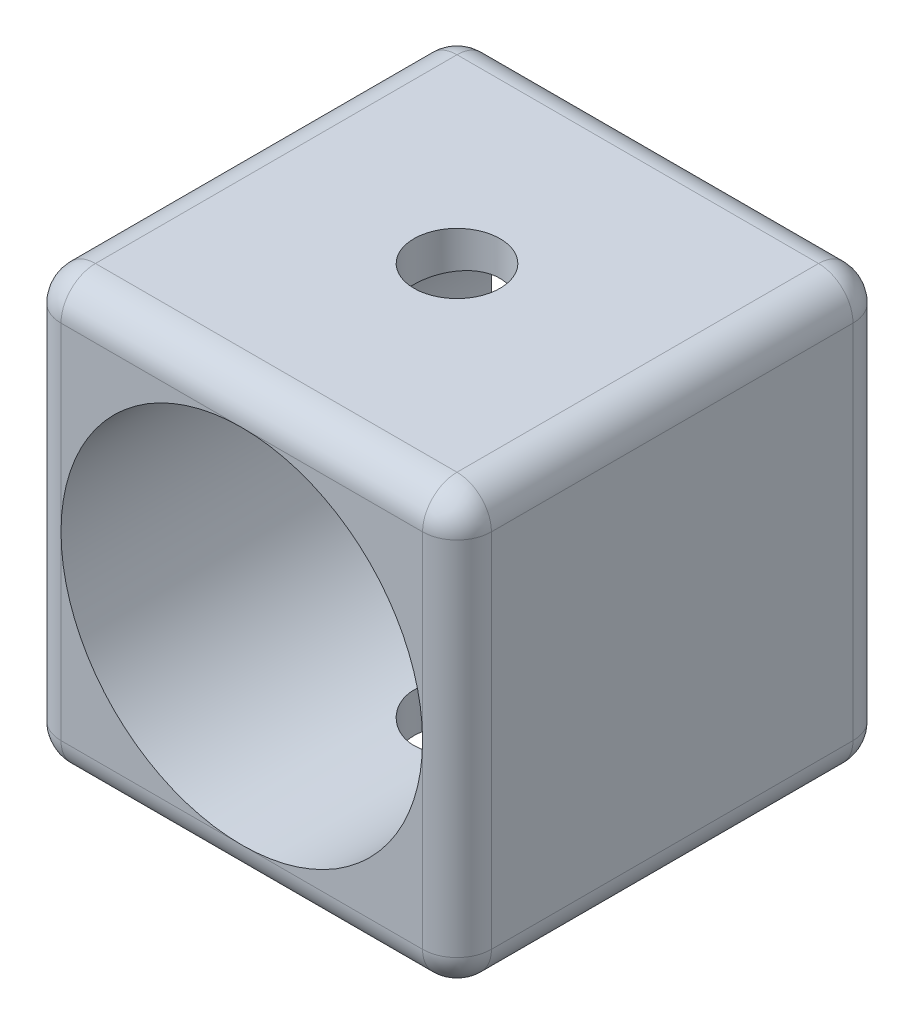
ISO-10303-21;
HEADER;
FILE_DESCRIPTION(('STEP AP214'),'2;1');
FILE_NAME('part.step','',(''),(''),'','','');
FILE_SCHEMA(('AUTOMOTIVE_DESIGN { 1 0 10303 214 1 1 1 1 }'));
ENDSEC;
DATA;
#1=APPLICATION_CONTEXT('core data for automotive mechanical design processes');
#2=APPLICATION_PROTOCOL_DEFINITION('international standard','automotive_design',2000,#1);
#3=PRODUCT_CONTEXT('',#1,'mechanical');
#4=PRODUCT('Part','Part','',(#3));
#5=PRODUCT_RELATED_PRODUCT_CATEGORY('part','',(#4));
#6=PRODUCT_DEFINITION_FORMATION('','',#4);
#7=PRODUCT_DEFINITION_CONTEXT('part definition',#1,'design');
#8=PRODUCT_DEFINITION('design','',#6,#7);
#9=PRODUCT_DEFINITION_SHAPE('','',#8);
#10=(LENGTH_UNIT() NAMED_UNIT(*) SI_UNIT(.MILLI.,.METRE.));
#11=(NAMED_UNIT(*) PLANE_ANGLE_UNIT() SI_UNIT($,.RADIAN.));
#12=(NAMED_UNIT(*) SI_UNIT($,.STERADIAN.) SOLID_ANGLE_UNIT());
#13=UNCERTAINTY_MEASURE_WITH_UNIT(LENGTH_MEASURE(1.E-05),#10,'distance_accuracy_value','');
#14=(GEOMETRIC_REPRESENTATION_CONTEXT(3) GLOBAL_UNCERTAINTY_ASSIGNED_CONTEXT((#13)) GLOBAL_UNIT_ASSIGNED_CONTEXT((#10,
#11,#12)) REPRESENTATION_CONTEXT('',''));
#15=CARTESIAN_POINT('',(0.,0.,0.));
#16=DIRECTION('',(0.,0.,1.));
#17=DIRECTION('',(1.,0.,0.));
#18=AXIS2_PLACEMENT_3D('',#15,#16,#17);
#19=CARTESIAN_POINT('',(12.5,25.,12.5));
#20=DIRECTION('',(0.,0.,-1.));
#21=DIRECTION('',(-1.,0.,0.));
#22=AXIS2_PLACEMENT_3D('',#19,#20,#21);
#23=PLANE('',#22);
#24=CARTESIAN_POINT('',(0.,12.5,12.5));
#25=DIRECTION('',(0.,0.,1.));
#26=DIRECTION('',(1.,0.,0.));
#27=AXIS2_PLACEMENT_3D('',#24,#25,#26);
#28=CIRCLE('',#27,10.5);
#29=CARTESIAN_POINT('',(0.,23.,12.5));
#30=VERTEX_POINT('',#29);
#31=CARTESIAN_POINT('',(-10.5,12.5,12.5));
#32=VERTEX_POINT('',#31);
#33=EDGE_CURVE('E391',#30,#32,#28,.T.);
#34=ORIENTED_EDGE('',*,*,#33,.F.);
#35=DIRECTION('',(1.,0.,0.));
#36=VECTOR('',#35,1.);
#37=CARTESIAN_POINT('',(-12.5,23.,12.5));
#38=LINE('',#37,#36);
#39=CARTESIAN_POINT('',(-10.5,23.,12.5));
#40=VERTEX_POINT('',#39);
#41=EDGE_CURVE('E285',#30,#40,#38,.F.);
#42=ORIENTED_EDGE('',*,*,#41,.T.);
#43=DIRECTION('',(0.,-1.,0.));
#44=VECTOR('',#43,1.);
#45=CARTESIAN_POINT('',(-10.5,25.,12.5));
#46=LINE('',#45,#44);
#47=EDGE_CURVE('E281',#40,#32,#46,.T.);
#48=ORIENTED_EDGE('',*,*,#47,.T.);
#49=EDGE_LOOP('',(#34,#42,#48));
#50=FACE_BOUND('',#49,.T.);
#51=ADVANCED_FACE('F38',(#50),#23,.F.);
#52=CARTESIAN_POINT('',(0.,2.,12.5));
#53=VERTEX_POINT('',#52);
#54=EDGE_CURVE('E493',#32,#53,#28,.T.);
#55=ORIENTED_EDGE('',*,*,#54,.F.);
#56=DIRECTION('',(0.,-1.,0.));
#57=VECTOR('',#56,1.);
#58=CARTESIAN_POINT('',(-10.5,25.,12.5));
#59=LINE('',#58,#57);
#60=CARTESIAN_POINT('',(-10.5,2.,12.5));
#61=VERTEX_POINT('',#60);
#62=EDGE_CURVE('E278',#32,#61,#59,.T.);
#63=ORIENTED_EDGE('',*,*,#62,.T.);
#64=DIRECTION('',(1.,0.,0.));
#65=VECTOR('',#64,1.);
#66=CARTESIAN_POINT('',(12.5,2.,12.5));
#67=LINE('',#66,#65);
#68=EDGE_CURVE('E273',#61,#53,#67,.T.);
#69=ORIENTED_EDGE('',*,*,#68,.T.);
#70=EDGE_LOOP('',(#55,#63,#69));
#71=FACE_BOUND('',#70,.T.);
#72=ADVANCED_FACE('F416',(#71),#23,.F.);
#73=DIRECTION('',(0.,-1.,0.));
#74=VECTOR('',#73,1.);
#75=CARTESIAN_POINT('',(10.5,25.,12.5));
#76=LINE('',#75,#74);
#77=CARTESIAN_POINT('',(10.5,12.5,12.5));
#78=VERTEX_POINT('',#77);
#79=CARTESIAN_POINT('',(10.5,23.,12.5));
#80=VERTEX_POINT('',#79);
#81=EDGE_CURVE('E264',#78,#80,#76,.F.);
#82=ORIENTED_EDGE('',*,*,#81,.T.);
#83=DIRECTION('',(1.,0.,0.));
#84=VECTOR('',#83,1.);
#85=CARTESIAN_POINT('',(-12.5,23.,12.5));
#86=LINE('',#85,#84);
#87=EDGE_CURVE('E171',#80,#30,#86,.F.);
#88=ORIENTED_EDGE('',*,*,#87,.T.);
#89=EDGE_CURVE('E388',#78,#30,#28,.T.);
#90=ORIENTED_EDGE('',*,*,#89,.F.);
#91=EDGE_LOOP('',(#82,#88,#90));
#92=FACE_BOUND('',#91,.T.);
#93=ADVANCED_FACE('F423',(#92),#23,.F.);
#94=CARTESIAN_POINT('',(12.5,25.,-12.5));
#95=DIRECTION('',(0.,0.,1.));
#96=DIRECTION('',(1.,0.,0.));
#97=AXIS2_PLACEMENT_3D('',#94,#95,#96);
#98=PLANE('',#97);
#99=CARTESIAN_POINT('',(0.,12.5,-12.5));
#100=DIRECTION('',(0.,0.,1.));
#101=DIRECTION('',(1.,0.,0.));
#102=AXIS2_PLACEMENT_3D('',#99,#100,#101);
#103=CIRCLE('',#102,10.5);
#104=CARTESIAN_POINT('',(0.,2.,-12.5));
#105=VERTEX_POINT('',#104);
#106=CARTESIAN_POINT('',(-10.5,12.5,-12.5));
#107=VERTEX_POINT('',#106);
#108=EDGE_CURVE('E196',#105,#107,#103,.F.);
#109=ORIENTED_EDGE('',*,*,#108,.F.);
#110=DIRECTION('',(-1.,0.,0.));
#111=VECTOR('',#110,1.);
#112=CARTESIAN_POINT('',(12.5,2.,-12.5));
#113=LINE('',#112,#111);
#114=CARTESIAN_POINT('',(-10.5,2.,-12.5));
#115=VERTEX_POINT('',#114);
#116=EDGE_CURVE('E235',#105,#115,#113,.T.);
#117=ORIENTED_EDGE('',*,*,#116,.T.);
#118=DIRECTION('',(0.,-1.,0.));
#119=VECTOR('',#118,1.);
#120=CARTESIAN_POINT('',(-10.5,25.,-12.5));
#121=LINE('',#120,#119);
#122=EDGE_CURVE('E232',#115,#107,#121,.F.);
#123=ORIENTED_EDGE('',*,*,#122,.T.);
#124=EDGE_LOOP('',(#109,#117,#123));
#125=FACE_BOUND('',#124,.T.);
#126=ADVANCED_FACE('F441',(#125),#98,.F.);
#127=CARTESIAN_POINT('',(0.,23.,-12.5));
#128=VERTEX_POINT('',#127);
#129=EDGE_CURVE('E504',#107,#128,#103,.F.);
#130=ORIENTED_EDGE('',*,*,#129,.F.);
#131=DIRECTION('',(0.,-1.,0.));
#132=VECTOR('',#131,1.);
#133=CARTESIAN_POINT('',(-10.5,25.,-12.5));
#134=LINE('',#133,#132);
#135=CARTESIAN_POINT('',(-10.5,23.,-12.5));
#136=VERTEX_POINT('',#135);
#137=EDGE_CURVE('E229',#107,#136,#134,.F.);
#138=ORIENTED_EDGE('',*,*,#137,.T.);
#139=DIRECTION('',(-1.,0.,0.));
#140=VECTOR('',#139,1.);
#141=CARTESIAN_POINT('',(12.5,23.,-12.5));
#142=LINE('',#141,#140);
#143=EDGE_CURVE('E225',#136,#128,#142,.F.);
#144=ORIENTED_EDGE('',*,*,#143,.T.);
#145=EDGE_LOOP('',(#130,#138,#144));
#146=FACE_BOUND('',#145,.T.);
#147=ADVANCED_FACE('F446',(#146),#98,.F.);
#148=CARTESIAN_POINT('',(10.5,12.5,-12.5));
#149=VERTEX_POINT('',#148);
#150=EDGE_CURVE('E198',#128,#149,#103,.F.);
#151=ORIENTED_EDGE('',*,*,#150,.F.);
#152=DIRECTION('',(-1.,0.,0.));
#153=VECTOR('',#152,1.);
#154=CARTESIAN_POINT('',(12.5,23.,-12.5));
#155=LINE('',#154,#153);
#156=CARTESIAN_POINT('',(10.5,23.,-12.5));
#157=VERTEX_POINT('',#156);
#158=EDGE_CURVE('E222',#128,#157,#155,.F.);
#159=ORIENTED_EDGE('',*,*,#158,.T.);
#160=DIRECTION('',(0.,-1.,0.));
#161=VECTOR('',#160,1.);
#162=CARTESIAN_POINT('',(10.5,25.,-12.5));
#163=LINE('',#162,#161);
#164=EDGE_CURVE('E216',#157,#149,#163,.T.);
#165=ORIENTED_EDGE('',*,*,#164,.T.);
#166=EDGE_LOOP('',(#151,#159,#165));
#167=FACE_BOUND('',#166,.T.);
#168=ADVANCED_FACE('F437',(#167),#98,.F.);
#169=CARTESIAN_POINT('',(-12.5,25.,12.5));
#170=DIRECTION('',(1.,0.,0.));
#171=DIRECTION('',(0.,0.,-1.));
#172=AXIS2_PLACEMENT_3D('',#169,#170,#171);
#173=PLANE('',#172);
#174=DIRECTION('',(0.,0.,1.));
#175=VECTOR('',#174,1.);
#176=CARTESIAN_POINT('',(-12.5,23.,-12.5));
#177=LINE('',#176,#175);
#178=CARTESIAN_POINT('',(-12.5,23.,10.5));
#179=VERTEX_POINT('',#178);
#180=CARTESIAN_POINT('',(-12.5,23.,-10.5));
#181=VERTEX_POINT('',#180);
#182=EDGE_CURVE('E257',#179,#181,#177,.F.);
#183=ORIENTED_EDGE('',*,*,#182,.T.);
#184=DIRECTION('',(0.,-1.,0.));
#185=VECTOR('',#184,1.);
#186=CARTESIAN_POINT('',(-12.5,25.,-10.5));
#187=LINE('',#186,#185);
#188=CARTESIAN_POINT('',(-12.5,2.,-10.5));
#189=VERTEX_POINT('',#188);
#190=EDGE_CURVE('E260',#181,#189,#187,.T.);
#191=ORIENTED_EDGE('',*,*,#190,.T.);
#192=DIRECTION('',(0.,0.,1.));
#193=VECTOR('',#192,1.);
#194=CARTESIAN_POINT('',(-12.5,2.,12.5));
#195=LINE('',#194,#193);
#196=CARTESIAN_POINT('',(-12.5,2.,10.5));
#197=VERTEX_POINT('',#196);
#198=EDGE_CURVE('E254',#189,#197,#195,.T.);
#199=ORIENTED_EDGE('',*,*,#198,.T.);
#200=DIRECTION('',(0.,-1.,0.));
#201=VECTOR('',#200,1.);
#202=CARTESIAN_POINT('',(-12.5,25.,10.5));
#203=LINE('',#202,#201);
#204=EDGE_CURVE('E251',#197,#179,#203,.F.);
#205=ORIENTED_EDGE('',*,*,#204,.T.);
#206=EDGE_LOOP('',(#183,#191,#199,#205));
#207=FACE_BOUND('',#206,.T.);
#208=ADVANCED_FACE('F430',(#207),#173,.F.);
#209=EDGE_CURVE('E392',#53,#78,#28,.T.);
#210=ORIENTED_EDGE('',*,*,#209,.F.);
#211=DIRECTION('',(1.,0.,0.));
#212=VECTOR('',#211,1.);
#213=CARTESIAN_POINT('',(12.5,2.,12.5));
#214=LINE('',#213,#212);
#215=CARTESIAN_POINT('',(10.5,2.,12.5));
#216=VERTEX_POINT('',#215);
#217=EDGE_CURVE('E270',#53,#216,#214,.T.);
#218=ORIENTED_EDGE('',*,*,#217,.T.);
#219=DIRECTION('',(0.,-1.,0.));
#220=VECTOR('',#219,1.);
#221=CARTESIAN_POINT('',(10.5,25.,12.5));
#222=LINE('',#221,#220);
#223=EDGE_CURVE('E267',#216,#78,#222,.F.);
#224=ORIENTED_EDGE('',*,*,#223,.T.);
#225=EDGE_LOOP('',(#210,#218,#224));
#226=FACE_BOUND('',#225,.T.);
#227=ADVANCED_FACE('F419',(#226),#23,.F.);
#228=CARTESIAN_POINT('',(12.5,25.,12.5));
#229=DIRECTION('',(-1.,0.,0.));
#230=DIRECTION('',(0.,0.,1.));
#231=AXIS2_PLACEMENT_3D('',#228,#229,#230);
#232=PLANE('',#231);
#233=DIRECTION('',(0.,0.,-1.));
#234=VECTOR('',#233,1.);
#235=CARTESIAN_POINT('',(12.5,23.,12.5));
#236=LINE('',#235,#234);
#237=CARTESIAN_POINT('',(12.5,23.,-10.5));
#238=VERTEX_POINT('',#237);
#239=CARTESIAN_POINT('',(12.5,23.,10.5));
#240=VERTEX_POINT('',#239);
#241=EDGE_CURVE('E48',#238,#240,#236,.F.);
#242=ORIENTED_EDGE('',*,*,#241,.T.);
#243=DIRECTION('',(0.,-1.,0.));
#244=VECTOR('',#243,1.);
#245=CARTESIAN_POINT('',(12.5,25.,10.5));
#246=LINE('',#245,#244);
#247=CARTESIAN_POINT('',(12.5,2.,10.5));
#248=VERTEX_POINT('',#247);
#249=EDGE_CURVE('E11',#240,#248,#246,.T.);
#250=ORIENTED_EDGE('',*,*,#249,.T.);
#251=DIRECTION('',(0.,0.,-1.));
#252=VECTOR('',#251,1.);
#253=CARTESIAN_POINT('',(12.5,2.,12.5));
#254=LINE('',#253,#252);
#255=CARTESIAN_POINT('',(12.5,2.,-10.5));
#256=VERTEX_POINT('',#255);
#257=EDGE_CURVE('E288',#248,#256,#254,.T.);
#258=ORIENTED_EDGE('',*,*,#257,.T.);
#259=DIRECTION('',(0.,-1.,0.));
#260=VECTOR('',#259,1.);
#261=CARTESIAN_POINT('',(12.5,25.,-10.5));
#262=LINE('',#261,#260);
#263=EDGE_CURVE('E59',#256,#238,#262,.F.);
#264=ORIENTED_EDGE('',*,*,#263,.T.);
#265=EDGE_LOOP('',(#242,#250,#258,#264));
#266=FACE_BOUND('',#265,.T.);
#267=ADVANCED_FACE('F429',(#266),#232,.F.);
#268=DIRECTION('',(0.,-1.,0.));
#269=VECTOR('',#268,1.);
#270=CARTESIAN_POINT('',(10.5,25.,-12.5));
#271=LINE('',#270,#269);
#272=CARTESIAN_POINT('',(10.5,2.,-12.5));
#273=VERTEX_POINT('',#272);
#274=EDGE_CURVE('E213',#149,#273,#271,.T.);
#275=ORIENTED_EDGE('',*,*,#274,.T.);
#276=DIRECTION('',(-1.,0.,0.));
#277=VECTOR('',#276,1.);
#278=CARTESIAN_POINT('',(12.5,2.,-12.5));
#279=LINE('',#278,#277);
#280=EDGE_CURVE('E219',#273,#105,#279,.T.);
#281=ORIENTED_EDGE('',*,*,#280,.T.);
#282=EDGE_CURVE('E192',#149,#105,#103,.F.);
#283=ORIENTED_EDGE('',*,*,#282,.F.);
#284=EDGE_LOOP('',(#275,#281,#283));
#285=FACE_BOUND('',#284,.T.);
#286=ADVANCED_FACE('F436',(#285),#98,.F.);
#287=CARTESIAN_POINT('',(0.,25.,0.));
#288=DIRECTION('',(0.,1.,0.));
#289=DIRECTION('',(0.,0.,1.));
#290=AXIS2_PLACEMENT_3D('',#287,#288,#289);
#291=PLANE('',#290);
#292=DIRECTION('',(0.,0.,-1.));
#293=VECTOR('',#292,1.);
#294=CARTESIAN_POINT('',(10.5,25.,-12.5));
#295=LINE('',#294,#293);
#296=CARTESIAN_POINT('',(10.5,25.,10.5));
#297=VERTEX_POINT('',#296);
#298=CARTESIAN_POINT('',(10.5,25.,-10.5));
#299=VERTEX_POINT('',#298);
#300=EDGE_CURVE('E156',#297,#299,#295,.T.);
#301=ORIENTED_EDGE('',*,*,#300,.T.);
#302=DIRECTION('',(-1.,0.,0.));
#303=VECTOR('',#302,1.);
#304=CARTESIAN_POINT('',(-12.5,25.,-10.5));
#305=LINE('',#304,#303);
#306=CARTESIAN_POINT('',(-10.5,25.,-10.5));
#307=VERTEX_POINT('',#306);
#308=EDGE_CURVE('E210',#299,#307,#305,.T.);
#309=ORIENTED_EDGE('',*,*,#308,.T.);
#310=DIRECTION('',(0.,0.,1.));
#311=VECTOR('',#310,1.);
#312=CARTESIAN_POINT('',(-10.5,25.,12.5));
#313=LINE('',#312,#311);
#314=CARTESIAN_POINT('',(-10.5,25.,10.5));
#315=VERTEX_POINT('',#314);
#316=EDGE_CURVE('E159',#307,#315,#313,.T.);
#317=ORIENTED_EDGE('',*,*,#316,.T.);
#318=DIRECTION('',(1.,0.,0.));
#319=VECTOR('',#318,1.);
#320=CARTESIAN_POINT('',(12.5,25.,10.5));
#321=LINE('',#320,#319);
#322=EDGE_CURVE('E150',#315,#297,#321,.T.);
#323=ORIENTED_EDGE('',*,*,#322,.T.);
#324=EDGE_LOOP('',(#301,#309,#317,#323));
#325=FACE_BOUND('',#324,.T.);
#326=CARTESIAN_POINT('',(0.,25.,0.));
#327=DIRECTION('',(0.,1.,0.));
#328=DIRECTION('',(0.,0.,1.));
#329=AXIS2_PLACEMENT_3D('',#326,#327,#328);
#330=CIRCLE('',#329,2.5);
#331=CARTESIAN_POINT('',(0.,25.,2.5));
#332=VERTEX_POINT('',#331);
#333=EDGE_CURVE('E372',#332,#332,#330,.T.);
#334=ORIENTED_EDGE('',*,*,#333,.F.);
#335=EDGE_LOOP('',(#334));
#336=FACE_BOUND('',#335,.T.);
#337=ADVANCED_FACE('F152',(#325,#336),#291,.T.);
#338=CARTESIAN_POINT('',(0.,0.,0.));
#339=DIRECTION('',(0.,1.,0.));
#340=DIRECTION('',(0.,0.,1.));
#341=AXIS2_PLACEMENT_3D('',#338,#339,#340);
#342=PLANE('',#341);
#343=DIRECTION('',(0.,0.,1.));
#344=VECTOR('',#343,1.);
#345=CARTESIAN_POINT('',(-10.5,0.,0.));
#346=LINE('',#345,#344);
#347=CARTESIAN_POINT('',(-10.5,0.,10.5));
#348=VERTEX_POINT('',#347);
#349=CARTESIAN_POINT('',(-10.5,0.,-10.5));
#350=VERTEX_POINT('',#349);
#351=EDGE_CURVE('E244',#348,#350,#346,.F.);
#352=ORIENTED_EDGE('',*,*,#351,.T.);
#353=DIRECTION('',(-1.,0.,0.));
#354=VECTOR('',#353,1.);
#355=CARTESIAN_POINT('',(0.,0.,-10.5));
#356=LINE('',#355,#354);
#357=CARTESIAN_POINT('',(10.5,0.,-10.5));
#358=VERTEX_POINT('',#357);
#359=EDGE_CURVE('E247',#350,#358,#356,.F.);
#360=ORIENTED_EDGE('',*,*,#359,.T.);
#361=DIRECTION('',(0.,0.,-1.));
#362=VECTOR('',#361,1.);
#363=CARTESIAN_POINT('',(10.5,0.,0.));
#364=LINE('',#363,#362);
#365=CARTESIAN_POINT('',(10.5,0.,10.5));
#366=VERTEX_POINT('',#365);
#367=EDGE_CURVE('E238',#358,#366,#364,.F.);
#368=ORIENTED_EDGE('',*,*,#367,.T.);
#369=DIRECTION('',(1.,0.,0.));
#370=VECTOR('',#369,1.);
#371=CARTESIAN_POINT('',(0.,0.,10.5));
#372=LINE('',#371,#370);
#373=EDGE_CURVE('E241',#366,#348,#372,.F.);
#374=ORIENTED_EDGE('',*,*,#373,.T.);
#375=EDGE_LOOP('',(#352,#360,#368,#374));
#376=FACE_BOUND('',#375,.T.);
#377=CARTESIAN_POINT('',(0.,0.,0.));
#378=DIRECTION('',(0.,1.,0.));
#379=DIRECTION('',(0.,0.,1.));
#380=AXIS2_PLACEMENT_3D('',#377,#378,#379);
#381=CIRCLE('',#380,2.5);
#382=CARTESIAN_POINT('',(0.,0.,2.5));
#383=VERTEX_POINT('',#382);
#384=EDGE_CURVE('E379',#383,#383,#381,.F.);
#385=ORIENTED_EDGE('',*,*,#384,.F.);
#386=EDGE_LOOP('',(#385));
#387=FACE_BOUND('',#386,.T.);
#388=ADVANCED_FACE('F666',(#376,#387),#342,.F.);
#389=CARTESIAN_POINT('',(0.,12.5,-42.198484809835));
#390=DIRECTION('',(0.,0.,1.));
#391=DIRECTION('',(1.,0.,0.));
#392=AXIS2_PLACEMENT_3D('',#389,#390,#391);
#393=CYLINDRICAL_SURFACE('',#392,10.5);
#394=CARTESIAN_POINT('',(0.,2.,2.5));
#395=CARTESIAN_POINT('',(-0.138336137279082,2.00000245654118,2.49999575819251));
#396=CARTESIAN_POINT('',(-0.276721109569138,2.00276129660495,2.48847917553527));
#397=CARTESIAN_POINT('',(-0.549538850757647,2.01349989148943,2.44277771328382));
#398=CARTESIAN_POINT('',(-0.68396909432786,2.0214829097517,2.40857866421765));
#399=CARTESIAN_POINT('',(-0.944897052807474,2.04178393830071,2.31866102738249));
#400=CARTESIAN_POINT('',(-1.07140361874548,2.05409700622448,2.26296696720246));
#401=CARTESIAN_POINT('',(-1.31327613755792,2.08173987945074,2.13172329037512));
#402=CARTESIAN_POINT('',(-1.42864197199632,2.09706971681895,2.05617346267483));
#403=CARTESIAN_POINT('',(-1.64712984534485,2.12939828497379,1.88586066510371));
#404=CARTESIAN_POINT('',(-1.75001240826077,2.14642081361976,1.7907949774152));
#405=CARTESIAN_POINT('',(-1.93853379683689,2.18005440458791,1.58479784361905));
#406=CARTESIAN_POINT('',(-2.02417084604484,2.19666542436635,1.47386476502989));
#407=CARTESIAN_POINT('',(-2.17686887987817,2.22783295737747,1.23745752478933));
#408=CARTESIAN_POINT('',(-2.24366710465667,2.24235914152476,1.11180928419932));
#409=CARTESIAN_POINT('',(-2.35510329990628,2.26736729290714,0.850666389094382));
#410=CARTESIAN_POINT('',(-2.39974445425967,2.27784984114824,0.715173152475589));
#411=CARTESIAN_POINT('',(-2.46479239184226,2.29334007984663,0.440806111439524));
#412=CARTESIAN_POINT('',(-2.48562721809095,2.29844433794547,0.302039363756058));
#413=CARTESIAN_POINT('',(-2.5038034744538,2.30288949580107,0.0228935000760924));
#414=CARTESIAN_POINT('',(-2.50114835178745,2.30223124122377,-0.117485376316072));
#415=CARTESIAN_POINT('',(-2.47276275553414,2.29531280488883,-0.392629656210277));
#416=CARTESIAN_POINT('',(-2.44753718505243,2.28917520331661,-0.527450706582173));
#417=CARTESIAN_POINT('',(-2.37553000240983,2.27218435899194,-0.790890260588694));
#418=CARTESIAN_POINT('',(-2.32874698257163,2.26133080829595,-0.919508358571521));
#419=CARTESIAN_POINT('',(-2.21450959138648,2.23601522545555,-1.16827068791426));
#420=CARTESIAN_POINT('',(-2.14686769876002,2.2215206894644,-1.28832535893375));
#421=CARTESIAN_POINT('',(-1.99296407487243,2.19057526743883,-1.51556352760122));
#422=CARTESIAN_POINT('',(-1.9066993668615,2.17412406883215,-1.62274496326893));
#423=CARTESIAN_POINT('',(-1.71536077381319,2.14059891209216,-1.82409310176282));
#424=CARTESIAN_POINT('',(-1.60985948183825,2.12351983029145,-1.91785325943471));
#425=CARTESIAN_POINT('',(-1.3844300128221,2.09104703914396,-2.08642325726278));
#426=CARTESIAN_POINT('',(-1.264501472065,2.07565337230576,-2.16123261951519));
#427=CARTESIAN_POINT('',(-1.01307505062908,2.04822042581308,-2.28990715828994));
#428=CARTESIAN_POINT('',(-0.881544829738132,2.03619093930115,-2.34371136509656));
#429=CARTESIAN_POINT('',(-0.610957907853852,2.01691345322874,-2.42833595037645));
#430=CARTESIAN_POINT('',(-0.471902513632525,2.00966462635511,-2.45916030572966));
#431=CARTESIAN_POINT('',(-0.193692828601947,2.00088579578693,-2.49634105337151));
#432=CARTESIAN_POINT('',(-0.0546165957888365,1.99922626478631,-2.50325173109353));
#433=CARTESIAN_POINT('',(0.222704057862656,2.00144644585287,-2.49392213075862));
#434=CARTESIAN_POINT('',(0.360948545283292,2.00532570844484,-2.47768373125828));
#435=CARTESIAN_POINT('',(0.630790741549755,2.01810507733656,-2.42297504325604));
#436=CARTESIAN_POINT('',(0.762452297252527,2.0269378946119,-2.38480253990954));
#437=CARTESIAN_POINT('',(1.01749963236655,2.04863209799945,-2.28764554746343));
#438=CARTESIAN_POINT('',(1.14088462227697,2.06149386777146,-2.22865907627172));
#439=CARTESIAN_POINT('',(1.37811619208856,2.09013355344704,-2.09044267384182));
#440=CARTESIAN_POINT('',(1.4917729035137,2.10595588127018,-2.0108962740785));
#441=CARTESIAN_POINT('',(1.70432235091455,2.13868396443127,-1.83422727743229));
#442=CARTESIAN_POINT('',(1.80321278453018,2.15558988813754,-1.73710194485136));
#443=CARTESIAN_POINT('',(1.98567065399475,2.18903872286017,-1.52546934736392));
#444=CARTESIAN_POINT('',(2.0688510846241,2.2055653504463,-1.41062533361608));
#445=CARTESIAN_POINT('',(2.21475282460654,2.23596346222951,-1.16827705871023));
#446=CARTESIAN_POINT('',(2.27747504973449,2.24983506526252,-1.04077336457346));
#447=CARTESIAN_POINT('',(2.38022508390675,2.27320643647494,-0.777420857405902));
#448=CARTESIAN_POINT('',(2.42038645459652,2.28273186980754,-0.641626549155698));
#449=CARTESIAN_POINT('',(2.47724487394362,2.29636689045691,-0.364955475839874));
#450=CARTESIAN_POINT('',(2.49394649367997,2.30047753282364,-0.224079706373772));
#451=CARTESIAN_POINT('',(2.50318954108941,2.30274253268823,0.0548322135741108));
#452=CARTESIAN_POINT('',(2.49634741508249,2.30104886918238,0.192847044585186));
#453=CARTESIAN_POINT('',(2.46009509206175,2.29224444564185,0.465695037149093));
#454=CARTESIAN_POINT('',(2.43068526979016,2.28513377555793,0.600528251495145));
#455=CARTESIAN_POINT('',(2.35045423221714,2.26637715378947,0.862586735269151));
#456=CARTESIAN_POINT('',(2.29973843208311,2.25475355182863,0.989845986360216));
#457=CARTESIAN_POINT('',(2.17842046384604,2.22827559676002,1.23413533197367));
#458=CARTESIAN_POINT('',(2.10781579881189,2.21342083805274,1.3511641397047));
#459=CARTESIAN_POINT('',(1.94674761804941,2.18171278687746,1.57467351092114));
#460=CARTESIAN_POINT('',(1.85585170179885,2.16482036295815,1.68083697749806));
#461=CARTESIAN_POINT('',(1.65763740981362,2.13118499220322,1.87660511814824));
#462=CARTESIAN_POINT('',(1.55031518959779,2.11444208133365,1.96620590495606));
#463=CARTESIAN_POINT('',(1.32022210682979,2.08267305800587,2.1276945106172));
#464=CARTESIAN_POINT('',(1.19723147883353,2.06767871206814,2.1992758785613));
#465=CARTESIAN_POINT('',(0.940622423064202,2.04142420825393,2.32063349378193));
#466=CARTESIAN_POINT('',(0.807012226205198,2.03016119266159,2.37042643759113));
#467=CARTESIAN_POINT('',(0.561236558719235,2.0144415649238,2.43880848080493));
#468=CARTESIAN_POINT('',(0.450309308650695,2.00906170003252,2.4617080738324));
#469=CARTESIAN_POINT('',(0.226265505747609,2.00184002202891,2.49230509941817));
#470=CARTESIAN_POINT('',(0.113149088362173,1.99999799072462,2.50000346949582));
#471=CARTESIAN_POINT('',(0.,2.,2.5));
#472=B_SPLINE_CURVE_WITH_KNOTS('',3,(#394,#395,#396,#397,#398,#399,#400,#401,#402,#403,#404,
#405,#406,#407,#408,#409,#410,#411,#412,#413,#414,#415,#416,#417,#418,#419,#420,#421,#422,#423,
#424,#425,#426,#427,#428,#429,#430,#431,#432,#433,#434,#435,#436,#437,#438,#439,#440,#441,#442,
#443,#444,#445,#446,#447,#448,#449,#450,#451,#452,#453,#454,#455,#456,#457,#458,#459,#460,#461,
#462,#463,#464,#465,#466,#467,#468,#469,#470,#471),.UNSPECIFIED.,.T.,.F.,(4,2,2,2,2,2,2,2,2,2,2,
2,2,2,2,2,2,2,2,2,2,2,2,2,2,2,2,2,2,2,2,2,2,2,2,2,2,2,4),(0.,0.414593955930678,
0.829447148107668,1.24382835136143,1.65821395937717,2.07959257414167,2.50101457274044,
2.92805259420199,3.3550292342317,3.77420157375972,4.1933123995274,4.60327579077322,
5.01326595596385,5.42705503347366,5.84091030182319,6.26543010829714,6.68996061930458,
7.11571437325671,7.54139442939284,7.9571392070003,8.37285024867883,8.78304648285508,
9.19328179013112,9.61025259265382,10.0272883415858,10.4535420182194,10.8797766117527,
11.3034605352545,11.7270618934519,12.1396574070664,12.5522460695774,12.9628169794916,
13.373439457181,13.7938286071533,14.2143162976454,14.6415339491407,15.0684236467355,
15.4075528325544,15.7466611022857),.UNSPECIFIED.);
#473=CARTESIAN_POINT('',(0.,2.,2.5));
#474=VERTEX_POINT('',#473);
#475=EDGE_CURVE('E200',#474,#474,#472,.T.);
#476=ORIENTED_EDGE('',*,*,#475,.T.);
#477=EDGE_LOOP('',(#476));
#478=FACE_BOUND('',#477,.T.);
#479=CARTESIAN_POINT('',(0.,23.,2.5));
#480=CARTESIAN_POINT('',(0.138336137279082,22.9999975434588,2.49999575819251));
#481=CARTESIAN_POINT('',(0.276721109569138,22.9972387033951,2.48847917553527));
#482=CARTESIAN_POINT('',(0.549538850757647,22.9865001085106,2.44277771328382));
#483=CARTESIAN_POINT('',(0.683969094327859,22.9785170902483,2.40857866421765));
#484=CARTESIAN_POINT('',(0.944897052807474,22.9582160616993,2.31866102738249));
#485=CARTESIAN_POINT('',(1.07140361874548,22.9459029937755,2.26296696720246));
#486=CARTESIAN_POINT('',(1.31327613755792,22.9182601205493,2.13172329037512));
#487=CARTESIAN_POINT('',(1.42864197199632,22.9029302831811,2.05617346267483));
#488=CARTESIAN_POINT('',(1.64712984534485,22.8706017150262,1.88586066510371));
#489=CARTESIAN_POINT('',(1.75001240826077,22.8535791863802,1.7907949774152));
#490=CARTESIAN_POINT('',(1.93853379683689,22.8199455954121,1.58479784361905));
#491=CARTESIAN_POINT('',(2.02417084604484,22.8033345756337,1.47386476502989));
#492=CARTESIAN_POINT('',(2.17686887987817,22.7721670426225,1.23745752478933));
#493=CARTESIAN_POINT('',(2.24366710465667,22.7576408584752,1.11180928419932));
#494=CARTESIAN_POINT('',(2.35510329990628,22.7326327070929,0.850666389094381));
#495=CARTESIAN_POINT('',(2.39974445425967,22.7221501588518,0.715173152475589));
#496=CARTESIAN_POINT('',(2.46479239184226,22.7066599201534,0.440806111439524));
#497=CARTESIAN_POINT('',(2.48562721809095,22.7015556620545,0.302039363756058));
#498=CARTESIAN_POINT('',(2.5038034744538,22.6971105041989,0.0228935000760923));
#499=CARTESIAN_POINT('',(2.50114835178745,22.6977687587762,-0.117485376316072));
#500=CARTESIAN_POINT('',(2.47276275553414,22.7046871951112,-0.392629656210277));
#501=CARTESIAN_POINT('',(2.44753718505243,22.7108247966834,-0.527450706582173));
#502=CARTESIAN_POINT('',(2.37553000240983,22.7278156410081,-0.790890260588693));
#503=CARTESIAN_POINT('',(2.32874698257163,22.7386691917041,-0.919508358571521));
#504=CARTESIAN_POINT('',(2.21450959138648,22.7639847745445,-1.16827068791426));
#505=CARTESIAN_POINT('',(2.14686769876002,22.7784793105356,-1.28832535893374));
#506=CARTESIAN_POINT('',(1.99296407487243,22.8094247325612,-1.51556352760122));
#507=CARTESIAN_POINT('',(1.9066993668615,22.8258759311679,-1.62274496326893));
#508=CARTESIAN_POINT('',(1.71536077381319,22.8594010879078,-1.82409310176283));
#509=CARTESIAN_POINT('',(1.60985948183825,22.8764801697085,-1.91785325943471));
#510=CARTESIAN_POINT('',(1.3844300128221,22.908952960856,-2.08642325726278));
#511=CARTESIAN_POINT('',(1.264501472065,22.9243466276942,-2.16123261951519));
#512=CARTESIAN_POINT('',(1.01307505062908,22.9517795741869,-2.28990715828994));
#513=CARTESIAN_POINT('',(0.881544829738131,22.9638090606989,-2.34371136509656));
#514=CARTESIAN_POINT('',(0.610957907853851,22.9830865467713,-2.42833595037645));
#515=CARTESIAN_POINT('',(0.471902513632525,22.9903353736449,-2.45916030572966));
#516=CARTESIAN_POINT('',(0.193692828601947,22.9991142042131,-2.49634105337151));
#517=CARTESIAN_POINT('',(0.0546165957888373,23.0007737352137,-2.50325173109353));
#518=CARTESIAN_POINT('',(-0.222704057862655,22.9985535541471,-2.49392213075862));
#519=CARTESIAN_POINT('',(-0.360948545283292,22.9946742915552,-2.47768373125828));
#520=CARTESIAN_POINT('',(-0.630790741549755,22.9818949226634,-2.42297504325604));
#521=CARTESIAN_POINT('',(-0.762452297252527,22.9730621053881,-2.38480253990954));
#522=CARTESIAN_POINT('',(-1.01749963236655,22.9513679020005,-2.28764554746343));
#523=CARTESIAN_POINT('',(-1.14088462227697,22.9385061322285,-2.22865907627172));
#524=CARTESIAN_POINT('',(-1.37811619208856,22.909866446553,-2.09044267384182));
#525=CARTESIAN_POINT('',(-1.4917729035137,22.8940441187298,-2.0108962740785));
#526=CARTESIAN_POINT('',(-1.70432235091455,22.8613160355687,-1.83422727743229));
#527=CARTESIAN_POINT('',(-1.80321278453018,22.8444101118625,-1.73710194485136));
#528=CARTESIAN_POINT('',(-1.98567065399475,22.8109612771398,-1.52546934736392));
#529=CARTESIAN_POINT('',(-2.0688510846241,22.7944346495537,-1.41062533361608));
#530=CARTESIAN_POINT('',(-2.21475282460654,22.7640365377705,-1.16827705871023));
#531=CARTESIAN_POINT('',(-2.27747504973449,22.7501649347375,-1.04077336457346));
#532=CARTESIAN_POINT('',(-2.38022508390675,22.7267935635251,-0.777420857405902));
#533=CARTESIAN_POINT('',(-2.42038645459652,22.7172681301925,-0.641626549155698));
#534=CARTESIAN_POINT('',(-2.47724487394362,22.7036331095431,-0.364955475839874));
#535=CARTESIAN_POINT('',(-2.49394649367997,22.6995224671764,-0.224079706373772));
#536=CARTESIAN_POINT('',(-2.50318954108941,22.6972574673118,0.0548322135741111));
#537=CARTESIAN_POINT('',(-2.49634741508249,22.6989511308176,0.192847044585186));
#538=CARTESIAN_POINT('',(-2.46009509206175,22.7077555543581,0.465695037149093));
#539=CARTESIAN_POINT('',(-2.43068526979016,22.7148662244421,0.600528251495145));
#540=CARTESIAN_POINT('',(-2.35045423221714,22.7336228462105,0.862586735269151));
#541=CARTESIAN_POINT('',(-2.29973843208311,22.7452464481714,0.989845986360216));
#542=CARTESIAN_POINT('',(-2.17842046384604,22.77172440324,1.23413533197367));
#543=CARTESIAN_POINT('',(-2.10781579881189,22.7865791619473,1.3511641397047));
#544=CARTESIAN_POINT('',(-1.94674761804941,22.8182872131225,1.57467351092114));
#545=CARTESIAN_POINT('',(-1.85585170179885,22.8351796370419,1.68083697749806));
#546=CARTESIAN_POINT('',(-1.65763740981362,22.8688150077968,1.87660511814824));
#547=CARTESIAN_POINT('',(-1.55031518959779,22.8855579186664,1.96620590495606));
#548=CARTESIAN_POINT('',(-1.32022210682979,22.9173269419941,2.1276945106172));
#549=CARTESIAN_POINT('',(-1.19723147883353,22.9323212879319,2.1992758785613));
#550=CARTESIAN_POINT('',(-0.940622423064201,22.9585757917461,2.32063349378193));
#551=CARTESIAN_POINT('',(-0.807012226205198,22.9698388073384,2.37042643759113));
#552=CARTESIAN_POINT('',(-0.561236558719235,22.9855584350762,2.43880848080493));
#553=CARTESIAN_POINT('',(-0.450309308650695,22.9909382999675,2.4617080738324));
#554=CARTESIAN_POINT('',(-0.226265505747609,22.9981599779711,2.49230509941817));
#555=CARTESIAN_POINT('',(-0.113149088362173,23.0000020092754,2.50000346949582));
#556=CARTESIAN_POINT('',(0.,23.,2.5));
#557=B_SPLINE_CURVE_WITH_KNOTS('',3,(#479,#480,#481,#482,#483,#484,#485,#486,#487,#488,#489,
#490,#491,#492,#493,#494,#495,#496,#497,#498,#499,#500,#501,#502,#503,#504,#505,#506,#507,#508,
#509,#510,#511,#512,#513,#514,#515,#516,#517,#518,#519,#520,#521,#522,#523,#524,#525,#526,#527,
#528,#529,#530,#531,#532,#533,#534,#535,#536,#537,#538,#539,#540,#541,#542,#543,#544,#545,#546,
#547,#548,#549,#550,#551,#552,#553,#554,#555,#556),.UNSPECIFIED.,.T.,.F.,(4,2,2,2,2,2,2,2,2,2,2,
2,2,2,2,2,2,2,2,2,2,2,2,2,2,2,2,2,2,2,2,2,2,2,2,2,2,2,4),(0.,0.414593955930678,
0.829447148107667,1.24382835136143,1.65821395937717,2.07959257414167,2.50101457274044,
2.92805259420199,3.3550292342317,3.77420157375972,4.1933123995274,4.60327579077322,
5.01326595596385,5.42705503347366,5.84091030182319,6.26543010829714,6.68996061930458,
7.11571437325671,7.54139442939284,7.95713920700029,8.37285024867883,8.78304648285508,
9.19328179013112,9.61025259265382,10.0272883415858,10.4535420182194,10.8797766117527,
11.3034605352545,11.7270618934519,12.1396574070664,12.5522460695774,12.9628169794916,
13.373439457181,13.7938286071533,14.2143162976454,14.6415339491407,15.0684236467355,
15.4075528325544,15.7466611022857),.UNSPECIFIED.);
#558=CARTESIAN_POINT('',(0.,23.,2.5));
#559=VERTEX_POINT('',#558);
#560=EDGE_CURVE('E385',#559,#559,#557,.T.);
#561=ORIENTED_EDGE('',*,*,#560,.T.);
#562=EDGE_LOOP('',(#561));
#563=FACE_BOUND('',#562,.T.);
#564=ORIENTED_EDGE('',*,*,#282,.T.);
#565=ORIENTED_EDGE('',*,*,#108,.T.);
#566=ORIENTED_EDGE('',*,*,#129,.T.);
#567=ORIENTED_EDGE('',*,*,#150,.T.);
#568=EDGE_LOOP('',(#564,#565,#566,#567));
#569=FACE_BOUND('',#568,.T.);
#570=ORIENTED_EDGE('',*,*,#89,.T.);
#571=ORIENTED_EDGE('',*,*,#33,.T.);
#572=ORIENTED_EDGE('',*,*,#54,.T.);
#573=ORIENTED_EDGE('',*,*,#209,.T.);
#574=EDGE_LOOP('',(#570,#571,#572,#573));
#575=FACE_BOUND('',#574,.T.);
#576=ADVANCED_FACE('F398',(#478,#563,#569,#575),#393,.F.);
#577=CARTESIAN_POINT('',(0.,-7.07106781186548,0.));
#578=DIRECTION('',(0.,1.,0.));
#579=DIRECTION('',(0.,0.,1.));
#580=AXIS2_PLACEMENT_3D('',#577,#578,#579);
#581=CYLINDRICAL_SURFACE('',#580,2.5);
#582=ORIENTED_EDGE('',*,*,#333,.T.);
#583=EDGE_LOOP('',(#582));
#584=FACE_BOUND('',#583,.T.);
#585=ORIENTED_EDGE('',*,*,#560,.F.);
#586=EDGE_LOOP('',(#585));
#587=FACE_BOUND('',#586,.T.);
#588=ADVANCED_FACE('F404',(#584,#587),#581,.F.);
#589=ORIENTED_EDGE('',*,*,#384,.T.);
#590=EDGE_LOOP('',(#589));
#591=FACE_BOUND('',#590,.T.);
#592=ORIENTED_EDGE('',*,*,#475,.F.);
#593=EDGE_LOOP('',(#592));
#594=FACE_BOUND('',#593,.T.);
#595=ADVANCED_FACE('F401',(#591,#594),#581,.F.);
#596=CARTESIAN_POINT('',(12.5,2.,10.5));
#597=DIRECTION('',(1.,0.,0.));
#598=DIRECTION('',(0.,0.,-1.));
#599=AXIS2_PLACEMENT_3D('',#596,#597,#598);
#600=CYLINDRICAL_SURFACE('',#599,2.);
#601=CARTESIAN_POINT('',(10.5,2.,10.5));
#602=DIRECTION('',(1.,0.,0.));
#603=DIRECTION('',(0.,0.,-1.));
#604=AXIS2_PLACEMENT_3D('',#601,#602,#603);
#605=CIRCLE('',#604,2.);
#606=EDGE_CURVE('E42',#216,#366,#605,.T.);
#607=ORIENTED_EDGE('',*,*,#606,.F.);
#608=ORIENTED_EDGE('',*,*,#217,.F.);
#609=ORIENTED_EDGE('',*,*,#68,.F.);
#610=CARTESIAN_POINT('',(-10.5,2.,10.5));
#611=DIRECTION('',(-1.,0.,0.));
#612=DIRECTION('',(0.,0.,1.));
#613=AXIS2_PLACEMENT_3D('',#610,#611,#612);
#614=CIRCLE('',#613,2.);
#615=EDGE_CURVE('E363',#348,#61,#614,.T.);
#616=ORIENTED_EDGE('',*,*,#615,.F.);
#617=ORIENTED_EDGE('',*,*,#373,.F.);
#618=EDGE_LOOP('',(#607,#608,#609,#616,#617));
#619=FACE_BOUND('',#618,.T.);
#620=ADVANCED_FACE('F40',(#619),#600,.T.);
#621=CARTESIAN_POINT('',(10.5,2.,10.5));
#622=DIRECTION('',(0.,-1.,0.));
#623=DIRECTION('',(0.,0.,-1.));
#624=AXIS2_PLACEMENT_3D('',#621,#622,#623);
#625=SPHERICAL_SURFACE('',#624,2.);
#626=CARTESIAN_POINT('',(10.5,2.,10.5));
#627=DIRECTION('',(0.,-1.,0.));
#628=DIRECTION('',(0.,0.,-1.));
#629=AXIS2_PLACEMENT_3D('',#626,#627,#628);
#630=CIRCLE('',#629,2.);
#631=EDGE_CURVE('E356',#216,#248,#630,.F.);
#632=ORIENTED_EDGE('',*,*,#631,.F.);
#633=ORIENTED_EDGE('',*,*,#606,.T.);
#634=CARTESIAN_POINT('',(10.5,2.,10.5));
#635=DIRECTION('',(0.,0.,1.));
#636=DIRECTION('',(1.,0.,0.));
#637=AXIS2_PLACEMENT_3D('',#634,#635,#636);
#638=CIRCLE('',#637,2.);
#639=EDGE_CURVE('E360',#248,#366,#638,.F.);
#640=ORIENTED_EDGE('',*,*,#639,.F.);
#641=EDGE_LOOP('',(#632,#633,#640));
#642=FACE_BOUND('',#641,.T.);
#643=ADVANCED_FACE('F412',(#642),#625,.T.);
#644=CARTESIAN_POINT('',(-10.5,2.,10.5));
#645=DIRECTION('',(0.,0.,1.));
#646=DIRECTION('',(1.,0.,0.));
#647=AXIS2_PLACEMENT_3D('',#644,#645,#646);
#648=SPHERICAL_SURFACE('',#647,2.);
#649=CARTESIAN_POINT('',(-10.5,2.,10.5));
#650=DIRECTION('',(0.,0.,1.));
#651=DIRECTION('',(1.,0.,0.));
#652=AXIS2_PLACEMENT_3D('',#649,#650,#651);
#653=CIRCLE('',#652,2.);
#654=EDGE_CURVE('E348',#348,#197,#653,.F.);
#655=ORIENTED_EDGE('',*,*,#654,.F.);
#656=ORIENTED_EDGE('',*,*,#615,.T.);
#657=CARTESIAN_POINT('',(-10.5,2.,10.5));
#658=DIRECTION('',(0.,-1.,0.));
#659=DIRECTION('',(0.,0.,-1.));
#660=AXIS2_PLACEMENT_3D('',#657,#658,#659);
#661=CIRCLE('',#660,2.);
#662=EDGE_CURVE('E352',#197,#61,#661,.F.);
#663=ORIENTED_EDGE('',*,*,#662,.F.);
#664=EDGE_LOOP('',(#655,#656,#663));
#665=FACE_BOUND('',#664,.T.);
#666=ADVANCED_FACE('F535',(#665),#648,.T.);
#667=CARTESIAN_POINT('',(10.5,2.,12.5));
#668=DIRECTION('',(0.,0.,-1.));
#669=DIRECTION('',(-1.,0.,0.));
#670=AXIS2_PLACEMENT_3D('',#667,#668,#669);
#671=CYLINDRICAL_SURFACE('',#670,2.);
#672=ORIENTED_EDGE('',*,*,#639,.T.);
#673=ORIENTED_EDGE('',*,*,#367,.F.);
#674=CARTESIAN_POINT('',(10.5,2.,-10.5));
#675=DIRECTION('',(0.,0.,-1.));
#676=DIRECTION('',(-1.,0.,0.));
#677=AXIS2_PLACEMENT_3D('',#674,#675,#676);
#678=CIRCLE('',#677,2.);
#679=EDGE_CURVE('E341',#256,#358,#678,.T.);
#680=ORIENTED_EDGE('',*,*,#679,.F.);
#681=ORIENTED_EDGE('',*,*,#257,.F.);
#682=EDGE_LOOP('',(#672,#673,#680,#681));
#683=FACE_BOUND('',#682,.T.);
#684=ADVANCED_FACE('F458',(#683),#671,.T.);
#685=CARTESIAN_POINT('',(10.5,25.,10.5));
#686=DIRECTION('',(0.,-1.,0.));
#687=DIRECTION('',(0.,0.,-1.));
#688=AXIS2_PLACEMENT_3D('',#685,#686,#687);
#689=CYLINDRICAL_SURFACE('',#688,2.);
#690=ORIENTED_EDGE('',*,*,#631,.T.);
#691=ORIENTED_EDGE('',*,*,#249,.F.);
#692=CARTESIAN_POINT('',(10.5,23.,10.5));
#693=DIRECTION('',(0.,1.,0.));
#694=DIRECTION('',(0.,0.,1.));
#695=AXIS2_PLACEMENT_3D('',#692,#693,#694);
#696=CIRCLE('',#695,2.);
#697=EDGE_CURVE('E176',#80,#240,#696,.T.);
#698=ORIENTED_EDGE('',*,*,#697,.F.);
#699=ORIENTED_EDGE('',*,*,#81,.F.);
#700=ORIENTED_EDGE('',*,*,#223,.F.);
#701=EDGE_LOOP('',(#690,#691,#698,#699,#700));
#702=FACE_BOUND('',#701,.T.);
#703=ADVANCED_FACE('F453',(#702),#689,.T.);
#704=CARTESIAN_POINT('',(0.,23.,10.5));
#705=DIRECTION('',(-1.,0.,0.));
#706=DIRECTION('',(0.,0.,1.));
#707=AXIS2_PLACEMENT_3D('',#704,#705,#706);
#708=CYLINDRICAL_SURFACE('',#707,2.);
#709=ORIENTED_EDGE('',*,*,#41,.F.);
#710=ORIENTED_EDGE('',*,*,#87,.F.);
#711=CARTESIAN_POINT('',(10.5,23.,10.5));
#712=DIRECTION('',(1.,0.,0.));
#713=DIRECTION('',(0.,0.,-1.));
#714=AXIS2_PLACEMENT_3D('',#711,#712,#713);
#715=CIRCLE('',#714,2.);
#716=EDGE_CURVE('E167',#297,#80,#715,.T.);
#717=ORIENTED_EDGE('',*,*,#716,.F.);
#718=ORIENTED_EDGE('',*,*,#322,.F.);
#719=CARTESIAN_POINT('',(-10.5,23.,10.5));
#720=DIRECTION('',(-1.,0.,0.));
#721=DIRECTION('',(0.,-1.,0.));
#722=AXIS2_PLACEMENT_3D('',#719,#720,#721);
#723=CIRCLE('',#722,2.);
#724=EDGE_CURVE('E177',#40,#315,#723,.T.);
#725=ORIENTED_EDGE('',*,*,#724,.F.);
#726=EDGE_LOOP('',(#709,#710,#717,#718,#725));
#727=FACE_BOUND('',#726,.T.);
#728=ADVANCED_FACE('F170',(#727),#708,.T.);
#729=CARTESIAN_POINT('',(-10.5,25.,10.5));
#730=DIRECTION('',(0.,-1.,0.));
#731=DIRECTION('',(0.,0.,-1.));
#732=AXIS2_PLACEMENT_3D('',#729,#730,#731);
#733=CYLINDRICAL_SURFACE('',#732,2.);
#734=ORIENTED_EDGE('',*,*,#62,.F.);
#735=ORIENTED_EDGE('',*,*,#47,.F.);
#736=CARTESIAN_POINT('',(-10.5,23.,10.5));
#737=DIRECTION('',(0.,1.,0.));
#738=DIRECTION('',(0.,0.,1.));
#739=AXIS2_PLACEMENT_3D('',#736,#737,#738);
#740=CIRCLE('',#739,2.);
#741=EDGE_CURVE('E333',#179,#40,#740,.T.);
#742=ORIENTED_EDGE('',*,*,#741,.F.);
#743=ORIENTED_EDGE('',*,*,#204,.F.);
#744=ORIENTED_EDGE('',*,*,#662,.T.);
#745=EDGE_LOOP('',(#734,#735,#742,#743,#744));
#746=FACE_BOUND('',#745,.T.);
#747=ADVANCED_FACE('F489',(#746),#733,.T.);
#748=CARTESIAN_POINT('',(-10.5,2.,12.5));
#749=DIRECTION('',(0.,0.,1.));
#750=DIRECTION('',(1.,0.,0.));
#751=AXIS2_PLACEMENT_3D('',#748,#749,#750);
#752=CYLINDRICAL_SURFACE('',#751,2.);
#753=ORIENTED_EDGE('',*,*,#654,.T.);
#754=ORIENTED_EDGE('',*,*,#198,.F.);
#755=CARTESIAN_POINT('',(-10.5,2.,-10.5));
#756=DIRECTION('',(0.,0.,-1.));
#757=DIRECTION('',(-1.,0.,0.));
#758=AXIS2_PLACEMENT_3D('',#755,#756,#757);
#759=CIRCLE('',#758,2.);
#760=EDGE_CURVE('E329',#350,#189,#759,.T.);
#761=ORIENTED_EDGE('',*,*,#760,.F.);
#762=ORIENTED_EDGE('',*,*,#351,.F.);
#763=EDGE_LOOP('',(#753,#754,#761,#762));
#764=FACE_BOUND('',#763,.T.);
#765=ADVANCED_FACE('F534',(#764),#752,.T.);
#766=CARTESIAN_POINT('',(12.5,2.,-10.5));
#767=DIRECTION('',(-1.,0.,0.));
#768=DIRECTION('',(0.,0.,1.));
#769=AXIS2_PLACEMENT_3D('',#766,#767,#768);
#770=CYLINDRICAL_SURFACE('',#769,2.);
#771=CARTESIAN_POINT('',(10.5,2.,-10.5));
#772=DIRECTION('',(1.,0.,0.));
#773=DIRECTION('',(0.,0.,-1.));
#774=AXIS2_PLACEMENT_3D('',#771,#772,#773);
#775=CIRCLE('',#774,2.);
#776=EDGE_CURVE('E344',#358,#273,#775,.T.);
#777=ORIENTED_EDGE('',*,*,#776,.F.);
#778=ORIENTED_EDGE('',*,*,#359,.F.);
#779=CARTESIAN_POINT('',(-10.5,2.,-10.5));
#780=DIRECTION('',(-1.,0.,0.));
#781=DIRECTION('',(0.,0.,1.));
#782=AXIS2_PLACEMENT_3D('',#779,#780,#781);
#783=CIRCLE('',#782,2.);
#784=EDGE_CURVE('E325',#115,#350,#783,.T.);
#785=ORIENTED_EDGE('',*,*,#784,.F.);
#786=ORIENTED_EDGE('',*,*,#116,.F.);
#787=ORIENTED_EDGE('',*,*,#280,.F.);
#788=EDGE_LOOP('',(#777,#778,#785,#786,#787));
#789=FACE_BOUND('',#788,.T.);
#790=ADVANCED_FACE('F524',(#789),#770,.T.);
#791=CARTESIAN_POINT('',(10.5,2.,-10.5));
#792=DIRECTION('',(0.,-1.,0.));
#793=DIRECTION('',(0.,0.,-1.));
#794=AXIS2_PLACEMENT_3D('',#791,#792,#793);
#795=SPHERICAL_SURFACE('',#794,2.);
#796=ORIENTED_EDGE('',*,*,#679,.T.);
#797=ORIENTED_EDGE('',*,*,#776,.T.);
#798=CARTESIAN_POINT('',(10.5,2.,-10.5));
#799=DIRECTION('',(0.,-1.,0.));
#800=DIRECTION('',(0.,0.,-1.));
#801=AXIS2_PLACEMENT_3D('',#798,#799,#800);
#802=CIRCLE('',#801,2.);
#803=EDGE_CURVE('E184',#256,#273,#802,.F.);
#804=ORIENTED_EDGE('',*,*,#803,.F.);
#805=EDGE_LOOP('',(#796,#797,#804));
#806=FACE_BOUND('',#805,.T.);
#807=ADVANCED_FACE('F461',(#806),#795,.T.);
#808=CARTESIAN_POINT('',(10.5,23.,10.5));
#809=DIRECTION('',(0.,0.,1.));
#810=DIRECTION('',(1.,0.,0.));
#811=AXIS2_PLACEMENT_3D('',#808,#809,#810);
#812=SPHERICAL_SURFACE('',#811,2.);
#813=ORIENTED_EDGE('',*,*,#716,.T.);
#814=ORIENTED_EDGE('',*,*,#697,.T.);
#815=CARTESIAN_POINT('',(10.5,23.,10.5));
#816=DIRECTION('',(0.,0.,1.));
#817=DIRECTION('',(1.,0.,0.));
#818=AXIS2_PLACEMENT_3D('',#815,#816,#817);
#819=CIRCLE('',#818,2.);
#820=EDGE_CURVE('E180',#297,#240,#819,.F.);
#821=ORIENTED_EDGE('',*,*,#820,.F.);
#822=EDGE_LOOP('',(#813,#814,#821));
#823=FACE_BOUND('',#822,.T.);
#824=ADVANCED_FACE('F181',(#823),#812,.T.);
#825=CARTESIAN_POINT('',(-10.5,23.,10.5));
#826=DIRECTION('',(0.,0.,1.));
#827=DIRECTION('',(1.,0.,0.));
#828=AXIS2_PLACEMENT_3D('',#825,#826,#827);
#829=SPHERICAL_SURFACE('',#828,2.);
#830=ORIENTED_EDGE('',*,*,#741,.T.);
#831=ORIENTED_EDGE('',*,*,#724,.T.);
#832=CARTESIAN_POINT('',(-10.5,23.,10.5));
#833=DIRECTION('',(0.,0.,1.));
#834=DIRECTION('',(1.,0.,0.));
#835=AXIS2_PLACEMENT_3D('',#832,#833,#834);
#836=CIRCLE('',#835,2.);
#837=EDGE_CURVE('E185',#179,#315,#836,.F.);
#838=ORIENTED_EDGE('',*,*,#837,.F.);
#839=EDGE_LOOP('',(#830,#831,#838));
#840=FACE_BOUND('',#839,.T.);
#841=ADVANCED_FACE('F483',(#840),#829,.T.);
#842=CARTESIAN_POINT('',(-10.5,2.,-10.5));
#843=DIRECTION('',(0.,-1.,0.));
#844=DIRECTION('',(0.,0.,-1.));
#845=AXIS2_PLACEMENT_3D('',#842,#843,#844);
#846=SPHERICAL_SURFACE('',#845,2.);
#847=ORIENTED_EDGE('',*,*,#784,.T.);
#848=ORIENTED_EDGE('',*,*,#760,.T.);
#849=CARTESIAN_POINT('',(-10.5,2.,-10.5));
#850=DIRECTION('',(0.,-1.,0.));
#851=DIRECTION('',(0.,0.,-1.));
#852=AXIS2_PLACEMENT_3D('',#849,#850,#851);
#853=CIRCLE('',#852,2.);
#854=EDGE_CURVE('E316',#115,#189,#853,.F.);
#855=ORIENTED_EDGE('',*,*,#854,.F.);
#856=EDGE_LOOP('',(#847,#848,#855));
#857=FACE_BOUND('',#856,.T.);
#858=ADVANCED_FACE('F530',(#857),#846,.T.);
#859=CARTESIAN_POINT('',(10.5,25.,-10.5));
#860=DIRECTION('',(0.,-1.,0.));
#861=DIRECTION('',(0.,0.,-1.));
#862=AXIS2_PLACEMENT_3D('',#859,#860,#861);
#863=CYLINDRICAL_SURFACE('',#862,2.);
#864=ORIENTED_EDGE('',*,*,#274,.F.);
#865=ORIENTED_EDGE('',*,*,#164,.F.);
#866=CARTESIAN_POINT('',(10.5,23.,-10.5));
#867=DIRECTION('',(0.,1.,0.));
#868=DIRECTION('',(0.,0.,1.));
#869=AXIS2_PLACEMENT_3D('',#866,#867,#868);
#870=CIRCLE('',#869,2.);
#871=EDGE_CURVE('E312',#238,#157,#870,.T.);
#872=ORIENTED_EDGE('',*,*,#871,.F.);
#873=ORIENTED_EDGE('',*,*,#263,.F.);
#874=ORIENTED_EDGE('',*,*,#803,.T.);
#875=EDGE_LOOP('',(#864,#865,#872,#873,#874));
#876=FACE_BOUND('',#875,.T.);
#877=ADVANCED_FACE('F465',(#876),#863,.T.);
#878=CARTESIAN_POINT('',(10.5,23.,0.));
#879=DIRECTION('',(0.,0.,1.));
#880=DIRECTION('',(1.,0.,0.));
#881=AXIS2_PLACEMENT_3D('',#878,#879,#880);
#882=CYLINDRICAL_SURFACE('',#881,2.);
#883=ORIENTED_EDGE('',*,*,#820,.T.);
#884=ORIENTED_EDGE('',*,*,#241,.F.);
#885=CARTESIAN_POINT('',(10.5,23.,-10.5));
#886=DIRECTION('',(0.,0.,-1.));
#887=DIRECTION('',(-1.,0.,0.));
#888=AXIS2_PLACEMENT_3D('',#885,#886,#887);
#889=CIRCLE('',#888,2.);
#890=EDGE_CURVE('E189',#299,#238,#889,.T.);
#891=ORIENTED_EDGE('',*,*,#890,.F.);
#892=ORIENTED_EDGE('',*,*,#300,.F.);
#893=EDGE_LOOP('',(#883,#884,#891,#892));
#894=FACE_BOUND('',#893,.T.);
#895=ADVANCED_FACE('F187',(#894),#882,.T.);
#896=CARTESIAN_POINT('',(-10.5,23.,0.));
#897=DIRECTION('',(0.,0.,-1.));
#898=DIRECTION('',(-1.,0.,0.));
#899=AXIS2_PLACEMENT_3D('',#896,#897,#898);
#900=CYLINDRICAL_SURFACE('',#899,2.);
#901=ORIENTED_EDGE('',*,*,#837,.T.);
#902=ORIENTED_EDGE('',*,*,#316,.F.);
#903=CARTESIAN_POINT('',(-10.5,23.,-10.5));
#904=DIRECTION('',(0.,0.,-1.));
#905=DIRECTION('',(0.,1.,0.));
#906=AXIS2_PLACEMENT_3D('',#903,#904,#905);
#907=CIRCLE('',#906,2.);
#908=EDGE_CURVE('E306',#181,#307,#907,.T.);
#909=ORIENTED_EDGE('',*,*,#908,.F.);
#910=ORIENTED_EDGE('',*,*,#182,.F.);
#911=EDGE_LOOP('',(#901,#902,#909,#910));
#912=FACE_BOUND('',#911,.T.);
#913=ADVANCED_FACE('F480',(#912),#900,.T.);
#914=CARTESIAN_POINT('',(-10.5,25.,-10.5));
#915=DIRECTION('',(0.,-1.,0.));
#916=DIRECTION('',(0.,0.,-1.));
#917=AXIS2_PLACEMENT_3D('',#914,#915,#916);
#918=CYLINDRICAL_SURFACE('',#917,2.);
#919=ORIENTED_EDGE('',*,*,#854,.T.);
#920=ORIENTED_EDGE('',*,*,#190,.F.);
#921=CARTESIAN_POINT('',(-10.5,23.,-10.5));
#922=DIRECTION('',(0.,1.,0.));
#923=DIRECTION('',(0.,0.,1.));
#924=AXIS2_PLACEMENT_3D('',#921,#922,#923);
#925=CIRCLE('',#924,2.);
#926=EDGE_CURVE('E302',#136,#181,#925,.T.);
#927=ORIENTED_EDGE('',*,*,#926,.F.);
#928=ORIENTED_EDGE('',*,*,#137,.F.);
#929=ORIENTED_EDGE('',*,*,#122,.F.);
#930=EDGE_LOOP('',(#919,#920,#927,#928,#929));
#931=FACE_BOUND('',#930,.T.);
#932=ADVANCED_FACE('F516',(#931),#918,.T.);
#933=CARTESIAN_POINT('',(10.5,23.,-10.5));
#934=DIRECTION('',(1.,0.,0.));
#935=DIRECTION('',(0.,0.,-1.));
#936=AXIS2_PLACEMENT_3D('',#933,#934,#935);
#937=SPHERICAL_SURFACE('',#936,2.);
#938=ORIENTED_EDGE('',*,*,#890,.T.);
#939=ORIENTED_EDGE('',*,*,#871,.T.);
#940=CARTESIAN_POINT('',(10.5,23.,-10.5));
#941=DIRECTION('',(1.,0.,0.));
#942=DIRECTION('',(0.,0.,-1.));
#943=AXIS2_PLACEMENT_3D('',#940,#941,#942);
#944=CIRCLE('',#943,2.);
#945=EDGE_CURVE('E298',#299,#157,#944,.F.);
#946=ORIENTED_EDGE('',*,*,#945,.F.);
#947=EDGE_LOOP('',(#938,#939,#946));
#948=FACE_BOUND('',#947,.T.);
#949=ADVANCED_FACE('F468',(#948),#937,.T.);
#950=CARTESIAN_POINT('',(-10.5,23.,-10.5));
#951=DIRECTION('',(-1.,0.,0.));
#952=DIRECTION('',(0.,0.,1.));
#953=AXIS2_PLACEMENT_3D('',#950,#951,#952);
#954=SPHERICAL_SURFACE('',#953,2.);
#955=ORIENTED_EDGE('',*,*,#926,.T.);
#956=ORIENTED_EDGE('',*,*,#908,.T.);
#957=CARTESIAN_POINT('',(-10.5,23.,-10.5));
#958=DIRECTION('',(-1.,0.,0.));
#959=DIRECTION('',(0.,0.,1.));
#960=AXIS2_PLACEMENT_3D('',#957,#958,#959);
#961=CIRCLE('',#960,2.);
#962=EDGE_CURVE('E295',#136,#307,#961,.F.);
#963=ORIENTED_EDGE('',*,*,#962,.F.);
#964=EDGE_LOOP('',(#955,#956,#963));
#965=FACE_BOUND('',#964,.T.);
#966=ADVANCED_FACE('F476',(#965),#954,.T.);
#967=CARTESIAN_POINT('',(0.,23.,-10.5));
#968=DIRECTION('',(1.,0.,0.));
#969=DIRECTION('',(0.,0.,-1.));
#970=AXIS2_PLACEMENT_3D('',#967,#968,#969);
#971=CYLINDRICAL_SURFACE('',#970,2.);
#972=ORIENTED_EDGE('',*,*,#158,.F.);
#973=ORIENTED_EDGE('',*,*,#143,.F.);
#974=ORIENTED_EDGE('',*,*,#962,.T.);
#975=ORIENTED_EDGE('',*,*,#308,.F.);
#976=ORIENTED_EDGE('',*,*,#945,.T.);
#977=EDGE_LOOP('',(#972,#973,#974,#975,#976));
#978=FACE_BOUND('',#977,.T.);
#979=ADVANCED_FACE('F471',(#978),#971,.T.);
#980=CLOSED_SHELL('',(#51,#72,#93,#126,#147,#168,#208,#227,#267,#286,#337,#388,#576,#588,#595,
#620,#643,#666,#684,#703,#728,#747,#765,#790,#807,#824,#841,#858,#877,#895,#913,#932,#949,#966,#979));
#981=MANIFOLD_SOLID_BREP('B2',#980);
#982=ADVANCED_BREP_SHAPE_REPRESENTATION('',(#18,#981),#14);
#983=SHAPE_DEFINITION_REPRESENTATION(#9,#982);
ENDSEC;
END-ISO-10303-21;
